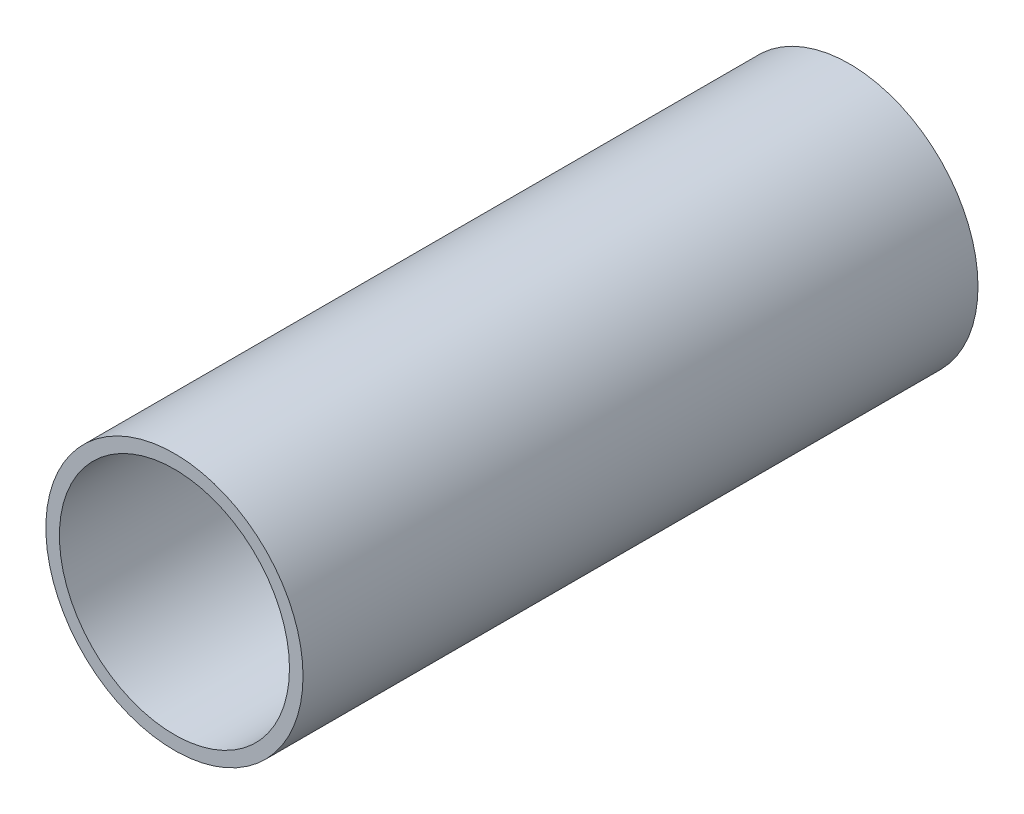
ISO-10303-21;
HEADER;
FILE_DESCRIPTION(('STEP AP214'),'2;1');
FILE_NAME('part.step','',(''),(''),'','','');
FILE_SCHEMA(('AUTOMOTIVE_DESIGN { 1 0 10303 214 1 1 1 1 }'));
ENDSEC;
DATA;
#1=APPLICATION_CONTEXT('core data for automotive mechanical design processes');
#2=APPLICATION_PROTOCOL_DEFINITION('international standard','automotive_design',2000,#1);
#3=PRODUCT_CONTEXT('',#1,'mechanical');
#4=PRODUCT('Part','Part','',(#3));
#5=PRODUCT_RELATED_PRODUCT_CATEGORY('part','',(#4));
#6=PRODUCT_DEFINITION_FORMATION('','',#4);
#7=PRODUCT_DEFINITION_CONTEXT('part definition',#1,'design');
#8=PRODUCT_DEFINITION('design','',#6,#7);
#9=PRODUCT_DEFINITION_SHAPE('','',#8);
#10=(LENGTH_UNIT() NAMED_UNIT(*) SI_UNIT(.MILLI.,.METRE.));
#11=(NAMED_UNIT(*) PLANE_ANGLE_UNIT() SI_UNIT($,.RADIAN.));
#12=(NAMED_UNIT(*) SI_UNIT($,.STERADIAN.) SOLID_ANGLE_UNIT());
#13=UNCERTAINTY_MEASURE_WITH_UNIT(LENGTH_MEASURE(1.E-05),#10,'distance_accuracy_value','');
#14=(GEOMETRIC_REPRESENTATION_CONTEXT(3) GLOBAL_UNCERTAINTY_ASSIGNED_CONTEXT((#13)) GLOBAL_UNIT_ASSIGNED_CONTEXT((#10,
#11,#12)) REPRESENTATION_CONTEXT('',''));
#15=CARTESIAN_POINT('',(0.,0.,0.));
#16=DIRECTION('',(0.,0.,1.));
#17=DIRECTION('',(1.,0.,0.));
#18=AXIS2_PLACEMENT_3D('',#15,#16,#17);
#19=CARTESIAN_POINT('',(0.,0.,150.));
#20=DIRECTION('',(0.,0.,1.));
#21=DIRECTION('',(1.,0.,0.));
#22=AXIS2_PLACEMENT_3D('',#19,#20,#21);
#23=PLANE('',#22);
#24=CARTESIAN_POINT('',(0.,0.,150.));
#25=DIRECTION('',(0.,0.,1.));
#26=DIRECTION('',(1.,0.,0.));
#27=AXIS2_PLACEMENT_3D('',#24,#25,#26);
#28=CIRCLE('',#27,57.15);
#29=CARTESIAN_POINT('',(57.15,0.,150.));
#30=VERTEX_POINT('',#29);
#31=EDGE_CURVE('E11',#30,#30,#28,.T.);
#32=ORIENTED_EDGE('',*,*,#31,.T.);
#33=EDGE_LOOP('',(#32));
#34=FACE_BOUND('',#33,.T.);
#35=CARTESIAN_POINT('',(0.,0.,150.));
#36=DIRECTION('',(0.,0.,1.));
#37=DIRECTION('',(1.,0.,0.));
#38=AXIS2_PLACEMENT_3D('',#35,#36,#37);
#39=CIRCLE('',#38,51.1302);
#40=CARTESIAN_POINT('',(51.1302,0.,150.));
#41=VERTEX_POINT('',#40);
#42=EDGE_CURVE('E47',#41,#41,#39,.T.);
#43=ORIENTED_EDGE('',*,*,#42,.F.);
#44=EDGE_LOOP('',(#43));
#45=FACE_BOUND('',#44,.T.);
#46=ADVANCED_FACE('F36',(#34,#45),#23,.T.);
#47=CARTESIAN_POINT('',(0.,0.,-150.));
#48=DIRECTION('',(0.,0.,1.));
#49=DIRECTION('',(1.,0.,0.));
#50=AXIS2_PLACEMENT_3D('',#47,#48,#49);
#51=PLANE('',#50);
#52=CARTESIAN_POINT('',(0.,0.,-150.));
#53=DIRECTION('',(0.,0.,1.));
#54=DIRECTION('',(1.,0.,0.));
#55=AXIS2_PLACEMENT_3D('',#52,#53,#54);
#56=CIRCLE('',#55,57.15);
#57=CARTESIAN_POINT('',(57.15,0.,-150.));
#58=VERTEX_POINT('',#57);
#59=EDGE_CURVE('E40',#58,#58,#56,.T.);
#60=ORIENTED_EDGE('',*,*,#59,.F.);
#61=EDGE_LOOP('',(#60));
#62=FACE_BOUND('',#61,.T.);
#63=CARTESIAN_POINT('',(0.,0.,-150.));
#64=DIRECTION('',(0.,0.,1.));
#65=DIRECTION('',(1.,0.,0.));
#66=AXIS2_PLACEMENT_3D('',#63,#64,#65);
#67=CIRCLE('',#66,51.1302);
#68=CARTESIAN_POINT('',(51.1302,0.,-150.));
#69=VERTEX_POINT('',#68);
#70=EDGE_CURVE('E49',#69,#69,#67,.T.);
#71=ORIENTED_EDGE('',*,*,#70,.T.);
#72=EDGE_LOOP('',(#71));
#73=FACE_BOUND('',#72,.T.);
#74=ADVANCED_FACE('F59',(#62,#73),#51,.F.);
#75=CARTESIAN_POINT('',(0.,0.,150.));
#76=DIRECTION('',(0.,0.,-1.));
#77=DIRECTION('',(-1.,0.,0.));
#78=AXIS2_PLACEMENT_3D('',#75,#76,#77);
#79=CYLINDRICAL_SURFACE('',#78,57.15);
#80=ORIENTED_EDGE('',*,*,#31,.F.);
#81=EDGE_LOOP('',(#80));
#82=FACE_BOUND('',#81,.T.);
#83=ORIENTED_EDGE('',*,*,#59,.T.);
#84=EDGE_LOOP('',(#83));
#85=FACE_BOUND('',#84,.T.);
#86=ADVANCED_FACE('F38',(#82,#85),#79,.T.);
#87=CARTESIAN_POINT('',(0.,0.,150.));
#88=DIRECTION('',(0.,0.,-1.));
#89=DIRECTION('',(-1.,0.,0.));
#90=AXIS2_PLACEMENT_3D('',#87,#88,#89);
#91=CYLINDRICAL_SURFACE('',#90,51.1302);
#92=ORIENTED_EDGE('',*,*,#42,.T.);
#93=EDGE_LOOP('',(#92));
#94=FACE_BOUND('',#93,.T.);
#95=ORIENTED_EDGE('',*,*,#70,.F.);
#96=EDGE_LOOP('',(#95));
#97=FACE_BOUND('',#96,.T.);
#98=ADVANCED_FACE('F55',(#94,#97),#91,.F.);
#99=CLOSED_SHELL('',(#46,#74,#86,#98));
#100=MANIFOLD_SOLID_BREP('B2',#99);
#101=ADVANCED_BREP_SHAPE_REPRESENTATION('',(#18,#100),#14);
#102=SHAPE_DEFINITION_REPRESENTATION(#9,#101);
ENDSEC;
END-ISO-10303-21;
